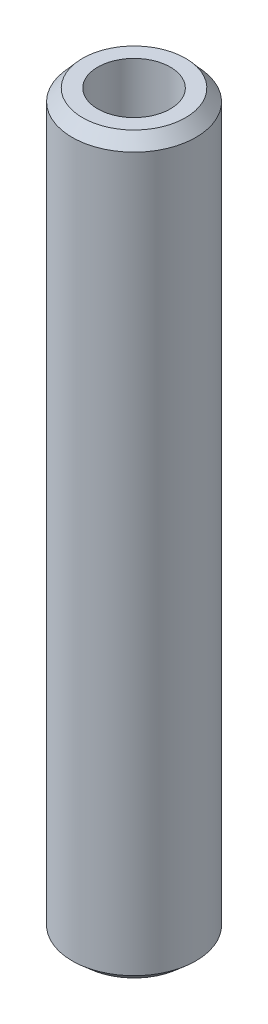
ISO-10303-21;
HEADER;
FILE_DESCRIPTION(('STEP AP214'),'2;1');
FILE_NAME('part.step','',(''),(''),'','','');
FILE_SCHEMA(('AUTOMOTIVE_DESIGN { 1 0 10303 214 1 1 1 1 }'));
ENDSEC;
DATA;
#1=APPLICATION_CONTEXT('core data for automotive mechanical design processes');
#2=APPLICATION_PROTOCOL_DEFINITION('international standard','automotive_design',2000,#1);
#3=PRODUCT_CONTEXT('',#1,'mechanical');
#4=PRODUCT('Part','Part','',(#3));
#5=PRODUCT_RELATED_PRODUCT_CATEGORY('part','',(#4));
#6=PRODUCT_DEFINITION_FORMATION('','',#4);
#7=PRODUCT_DEFINITION_CONTEXT('part definition',#1,'design');
#8=PRODUCT_DEFINITION('design','',#6,#7);
#9=PRODUCT_DEFINITION_SHAPE('','',#8);
#10=(LENGTH_UNIT() NAMED_UNIT(*) SI_UNIT(.MILLI.,.METRE.));
#11=(NAMED_UNIT(*) PLANE_ANGLE_UNIT() SI_UNIT($,.RADIAN.));
#12=(NAMED_UNIT(*) SI_UNIT($,.STERADIAN.) SOLID_ANGLE_UNIT());
#13=UNCERTAINTY_MEASURE_WITH_UNIT(LENGTH_MEASURE(1.E-05),#10,'distance_accuracy_value','');
#14=(GEOMETRIC_REPRESENTATION_CONTEXT(3) GLOBAL_UNCERTAINTY_ASSIGNED_CONTEXT((#13)) GLOBAL_UNIT_ASSIGNED_CONTEXT((#10,
#11,#12)) REPRESENTATION_CONTEXT('',''));
#15=CARTESIAN_POINT('',(0.,0.,0.));
#16=DIRECTION('',(0.,0.,1.));
#17=DIRECTION('',(1.,0.,0.));
#18=AXIS2_PLACEMENT_3D('',#15,#16,#17);
#19=CARTESIAN_POINT('',(0.,326.854234603589,0.));
#20=DIRECTION('',(0.,-1.,0.));
#21=DIRECTION('',(0.,0.,-1.));
#22=AXIS2_PLACEMENT_3D('',#19,#20,#21);
#23=CYLINDRICAL_SURFACE('',#22,27.5);
#24=CARTESIAN_POINT('',(0.,321.58298742481,0.));
#25=DIRECTION('',(0.,1.,0.));
#26=DIRECTION('',(0.,0.,1.));
#27=AXIS2_PLACEMENT_3D('',#24,#25,#26);
#28=CIRCLE('',#27,27.5);
#29=CARTESIAN_POINT('',(0.,321.58298742481,-27.5));
#30=VERTEX_POINT('',#29);
#31=EDGE_CURVE('E50',#30,#30,#28,.F.);
#32=ORIENTED_EDGE('',*,*,#31,.T.);
#33=EDGE_LOOP('',(#32));
#34=FACE_BOUND('',#33,.T.);
#35=CARTESIAN_POINT('',(0.,4.61449500627781,0.));
#36=DIRECTION('',(0.,1.,0.));
#37=DIRECTION('',(0.,0.,1.));
#38=AXIS2_PLACEMENT_3D('',#35,#36,#37);
#39=CIRCLE('',#38,27.5);
#40=CARTESIAN_POINT('',(0.,4.61449500627781,27.5));
#41=VERTEX_POINT('',#40);
#42=EDGE_CURVE('E51',#41,#41,#39,.T.);
#43=ORIENTED_EDGE('',*,*,#42,.T.);
#44=EDGE_LOOP('',(#43));
#45=FACE_BOUND('',#44,.T.);
#46=ADVANCED_FACE('F39',(#34,#45),#23,.T.);
#47=CARTESIAN_POINT('',(0.,326.854234603589,0.));
#48=DIRECTION('',(0.,1.,0.));
#49=DIRECTION('',(0.,0.,1.));
#50=AXIS2_PLACEMENT_3D('',#47,#48,#49);
#51=PLANE('',#50);
#52=CARTESIAN_POINT('',(0.,326.854234603589,0.));
#53=DIRECTION('',(0.,1.,0.));
#54=DIRECTION('',(0.,0.,1.));
#55=AXIS2_PLACEMENT_3D('',#52,#53,#54);
#56=CIRCLE('',#55,22.8855049937221);
#57=CARTESIAN_POINT('',(0.,326.854234603589,-22.8855049937221));
#58=VERTEX_POINT('',#57);
#59=EDGE_CURVE('E54',#58,#58,#56,.T.);
#60=ORIENTED_EDGE('',*,*,#59,.T.);
#61=EDGE_LOOP('',(#60));
#62=FACE_BOUND('',#61,.T.);
#63=CARTESIAN_POINT('',(0.,326.854234603589,0.));
#64=DIRECTION('',(0.,1.,0.));
#65=DIRECTION('',(0.,0.,1.));
#66=AXIS2_PLACEMENT_3D('',#63,#64,#65);
#67=CIRCLE('',#66,16.1286445552313);
#68=CARTESIAN_POINT('',(0.,326.854234603589,16.1286445552313));
#69=VERTEX_POINT('',#68);
#70=EDGE_CURVE('E58',#69,#69,#67,.T.);
#71=ORIENTED_EDGE('',*,*,#70,.F.);
#72=EDGE_LOOP('',(#71));
#73=FACE_BOUND('',#72,.T.);
#74=ADVANCED_FACE('F69',(#62,#73),#51,.T.);
#75=CARTESIAN_POINT('',(0.,0.,0.));
#76=DIRECTION('',(0.,1.,0.));
#77=DIRECTION('',(0.,0.,1.));
#78=AXIS2_PLACEMENT_3D('',#75,#76,#77);
#79=PLANE('',#78);
#80=CARTESIAN_POINT('',(0.,0.,0.));
#81=DIRECTION('',(0.,1.,0.));
#82=DIRECTION('',(0.,0.,1.));
#83=AXIS2_PLACEMENT_3D('',#80,#81,#82);
#84=CIRCLE('',#83,22.2287528212218);
#85=CARTESIAN_POINT('',(0.,0.,22.2287528212218));
#86=VERTEX_POINT('',#85);
#87=EDGE_CURVE('E10',#86,#86,#84,.F.);
#88=ORIENTED_EDGE('',*,*,#87,.T.);
#89=EDGE_LOOP('',(#88));
#90=FACE_BOUND('',#89,.T.);
#91=CARTESIAN_POINT('',(0.,0.,0.));
#92=DIRECTION('',(0.,1.,0.));
#93=DIRECTION('',(0.,0.,1.));
#94=AXIS2_PLACEMENT_3D('',#91,#92,#93);
#95=CIRCLE('',#94,16.1286445552313);
#96=CARTESIAN_POINT('',(0.,0.,16.1286445552313));
#97=VERTEX_POINT('',#96);
#98=EDGE_CURVE('E63',#97,#97,#95,.T.);
#99=ORIENTED_EDGE('',*,*,#98,.T.);
#100=EDGE_LOOP('',(#99));
#101=FACE_BOUND('',#100,.T.);
#102=ADVANCED_FACE('F75',(#90,#101),#79,.F.);
#103=CARTESIAN_POINT('',(0.,326.854234603589,0.));
#104=DIRECTION('',(0.,-1.,0.));
#105=DIRECTION('',(0.,0.,-1.));
#106=AXIS2_PLACEMENT_3D('',#103,#104,#105);
#107=CYLINDRICAL_SURFACE('',#106,16.1286445552313);
#108=ORIENTED_EDGE('',*,*,#70,.T.);
#109=EDGE_LOOP('',(#108));
#110=FACE_BOUND('',#109,.T.);
#111=ORIENTED_EDGE('',*,*,#98,.F.);
#112=EDGE_LOOP('',(#111));
#113=FACE_BOUND('',#112,.T.);
#114=ADVANCED_FACE('F70',(#110,#113),#107,.F.);
#115=CARTESIAN_POINT('',(0.,326.854234603589,0.));
#116=DIRECTION('',(0.,-1.,0.));
#117=DIRECTION('',(0.,0.,-1.));
#118=AXIS2_PLACEMENT_3D('',#115,#116,#117);
#119=CONICAL_SURFACE('',#118,22.8855049937221,0.719061360770218);
#120=CARTESIAN_POINT('',(0.,321.58298742481,-27.5));
#121=CARTESIAN_POINT('',(0.,321.637896249589,-27.4519323436846));
#122=CARTESIAN_POINT('',(0.,321.692805074368,-27.4038646873692));
#123=CARTESIAN_POINT('',(0.,321.802622723926,-27.3077293747384));
#124=CARTESIAN_POINT('',(0.,321.857531548705,-27.259661718423));
#125=CARTESIAN_POINT('',(0.,321.967349198263,-27.1635264057923));
#126=CARTESIAN_POINT('',(0.,322.022258023042,-27.1154587494769));
#127=CARTESIAN_POINT('',(0.,322.1320756726,-27.0193234368461));
#128=CARTESIAN_POINT('',(0.,322.186984497379,-26.9712557805307));
#129=CARTESIAN_POINT('',(0.,322.296802146936,-26.8751204678999));
#130=CARTESIAN_POINT('',(0.,322.351710971715,-26.8270528115845));
#131=CARTESIAN_POINT('',(0.,322.461528621273,-26.7309174989537));
#132=CARTESIAN_POINT('',(0.,322.516437446052,-26.6828498426383));
#133=CARTESIAN_POINT('',(0.,322.62625509561,-26.5867145300075));
#134=CARTESIAN_POINT('',(0.,322.681163920389,-26.5386468736921));
#135=CARTESIAN_POINT('',(0.,322.790981569947,-26.4425115610613));
#136=CARTESIAN_POINT('',(0.,322.845890394726,-26.3944439047459));
#137=CARTESIAN_POINT('',(0.,322.955708044284,-26.2983085921151));
#138=CARTESIAN_POINT('',(0.,323.010616869063,-26.2502409357998));
#139=CARTESIAN_POINT('',(0.,323.120434518621,-26.154105623169));
#140=CARTESIAN_POINT('',(0.,323.1753433434,-26.1060379668536));
#141=CARTESIAN_POINT('',(0.,323.285160992957,-26.0099026542228));
#142=CARTESIAN_POINT('',(0.,323.340069817736,-25.9618349979074));
#143=CARTESIAN_POINT('',(0.,323.449887467294,-25.8656996852766));
#144=CARTESIAN_POINT('',(0.,323.504796292073,-25.8176320289612));
#145=CARTESIAN_POINT('',(0.,323.614613941631,-25.7214967163304));
#146=CARTESIAN_POINT('',(0.,323.66952276641,-25.673429060015));
#147=CARTESIAN_POINT('',(0.,323.779340415968,-25.5772937473842));
#148=CARTESIAN_POINT('',(0.,323.834249240747,-25.5292260910688));
#149=CARTESIAN_POINT('',(0.,323.944066890305,-25.433090778438));
#150=CARTESIAN_POINT('',(0.,323.998975715084,-25.3850231221226));
#151=CARTESIAN_POINT('',(0.,324.108793364642,-25.2888878094919));
#152=CARTESIAN_POINT('',(0.,324.163702189421,-25.2408201531765));
#153=CARTESIAN_POINT('',(0.,324.273519838978,-25.1446848405457));
#154=CARTESIAN_POINT('',(0.,324.328428663757,-25.0966171842303));
#155=CARTESIAN_POINT('',(0.,324.438246313315,-25.0004818715995));
#156=CARTESIAN_POINT('',(0.,324.493155138094,-24.9524142152841));
#157=CARTESIAN_POINT('',(0.,324.602972787652,-24.8562789026533));
#158=CARTESIAN_POINT('',(0.,324.657881612431,-24.8082112463379));
#159=CARTESIAN_POINT('',(0.,324.767699261989,-24.7120759337071));
#160=CARTESIAN_POINT('',(0.,324.822608086768,-24.6640082773917));
#161=CARTESIAN_POINT('',(0.,324.932425736326,-24.5678729647609));
#162=CARTESIAN_POINT('',(0.,324.987334561105,-24.5198053084455));
#163=CARTESIAN_POINT('',(0.,325.097152210663,-24.4236699958148));
#164=CARTESIAN_POINT('',(0.,325.152061035441,-24.3756023394993));
#165=CARTESIAN_POINT('',(0.,325.261878684999,-24.2794670268686));
#166=CARTESIAN_POINT('',(0.,325.316787509778,-24.2313993705532));
#167=CARTESIAN_POINT('',(0.,325.426605159336,-24.1352640579224));
#168=CARTESIAN_POINT('',(0.,325.481513984115,-24.087196401607));
#169=CARTESIAN_POINT('',(0.,325.591331633673,-23.9910610889762));
#170=CARTESIAN_POINT('',(0.,325.646240458452,-23.9429934326608));
#171=CARTESIAN_POINT('',(0.,325.75605810801,-23.84685812003));
#172=CARTESIAN_POINT('',(0.,325.810966932789,-23.7987904637146));
#173=CARTESIAN_POINT('',(0.,325.920784582347,-23.7026551510838));
#174=CARTESIAN_POINT('',(0.,325.975693407126,-23.6545874947684));
#175=CARTESIAN_POINT('',(0.,326.085511056683,-23.5584521821376));
#176=CARTESIAN_POINT('',(0.,326.140419881462,-23.5103845258222));
#177=CARTESIAN_POINT('',(0.,326.25023753102,-23.4142492131915));
#178=CARTESIAN_POINT('',(0.,326.305146355799,-23.3661815568761));
#179=CARTESIAN_POINT('',(0.,326.414964005357,-23.2700462442453));
#180=CARTESIAN_POINT('',(0.,326.469872830136,-23.2219785879299));
#181=CARTESIAN_POINT('',(0.,326.579690479694,-23.1258432752991));
#182=CARTESIAN_POINT('',(0.,326.634599304473,-23.0777756189837));
#183=CARTESIAN_POINT('',(0.,326.744416954031,-22.9816403063529));
#184=CARTESIAN_POINT('',(0.,326.79932577881,-22.9335726500375));
#185=CARTESIAN_POINT('',(0.,326.854234603589,-22.8855049937221));
#186=B_SPLINE_CURVE_WITH_KNOTS('',3,(#120,#121,#122,#123,#124,#125,#126,#127,#128,#129,#130,
#131,#132,#133,#134,#135,#136,#137,#138,#139,#140,#141,#142,#143,#144,#145,#146,#147,#148,#149,
#150,#151,#152,#153,#154,#155,#156,#157,#158,#159,#160,#161,#162,#163,#164,#165,#166,#167,#168,
#169,#170,#171,#172,#173,#174,#175,#176,#177,#178,#179,#180,#181,#182,#183,#184,#185),
.UNSPECIFIED.,.F.,.F.,(4,2,2,2,2,2,2,2,2,2,2,2,2,2,2,2,2,2,2,2,2,2,2,2,2,2,2,2,2,2,2,2,4),(0.,
0.218927630965865,0.437855261931728,0.656782892897632,0.875710523863498,1.0946381548294,
1.31356578579527,1.53249341676117,1.75142104772704,1.9703486786929,2.18927630965881,
2.40820394062467,2.62713157159058,2.84605920255644,3.06498683352234,3.28391446448821,
3.50284209545411,3.72176972641998,3.94069735738584,4.15962498835175,4.37855261931761,
4.59748025028352,4.81640788124938,5.03533551221529,5.25426314318115,5.47319077414702,
5.69211840511292,5.91104603607879,6.12997366704469,6.34890129801056,6.56782892897646,
6.78675655994232,7.00568419090823),.UNSPECIFIED.);
#187=EDGE_CURVE('BSEAM81',#30,#58,#186,.T.);
#188=ORIENTED_EDGE('',*,*,#31,.F.);
#189=ORIENTED_EDGE('',*,*,#59,.F.);
#190=ORIENTED_EDGE('',*,*,#187,.T.);
#191=ORIENTED_EDGE('',*,*,#187,.F.);
#192=EDGE_LOOP('',(#188,#190,#189,#191));
#193=FACE_BOUND('',#192,.T.);
#194=ADVANCED_FACE('F81',(#193),#119,.T.);
#195=CARTESIAN_POINT('',(0.,4.61449500627781,0.));
#196=DIRECTION('',(0.,1.,0.));
#197=DIRECTION('',(0.,0.,1.));
#198=AXIS2_PLACEMENT_3D('',#195,#196,#197);
#199=CONICAL_SURFACE('',#198,27.5,0.851734966024686);
#200=ORIENTED_EDGE('',*,*,#87,.F.);
#201=EDGE_LOOP('',(#200));
#202=FACE_BOUND('',#201,.T.);
#203=ORIENTED_EDGE('',*,*,#42,.F.);
#204=EDGE_LOOP('',(#203));
#205=FACE_BOUND('',#204,.T.);
#206=ADVANCED_FACE('F45',(#202,#205),#199,.T.);
#207=CLOSED_SHELL('',(#46,#74,#102,#114,#194,#206));
#208=MANIFOLD_SOLID_BREP('B2',#207);
#209=ADVANCED_BREP_SHAPE_REPRESENTATION('',(#18,#208),#14);
#210=SHAPE_DEFINITION_REPRESENTATION(#9,#209);
ENDSEC;
END-ISO-10303-21;
